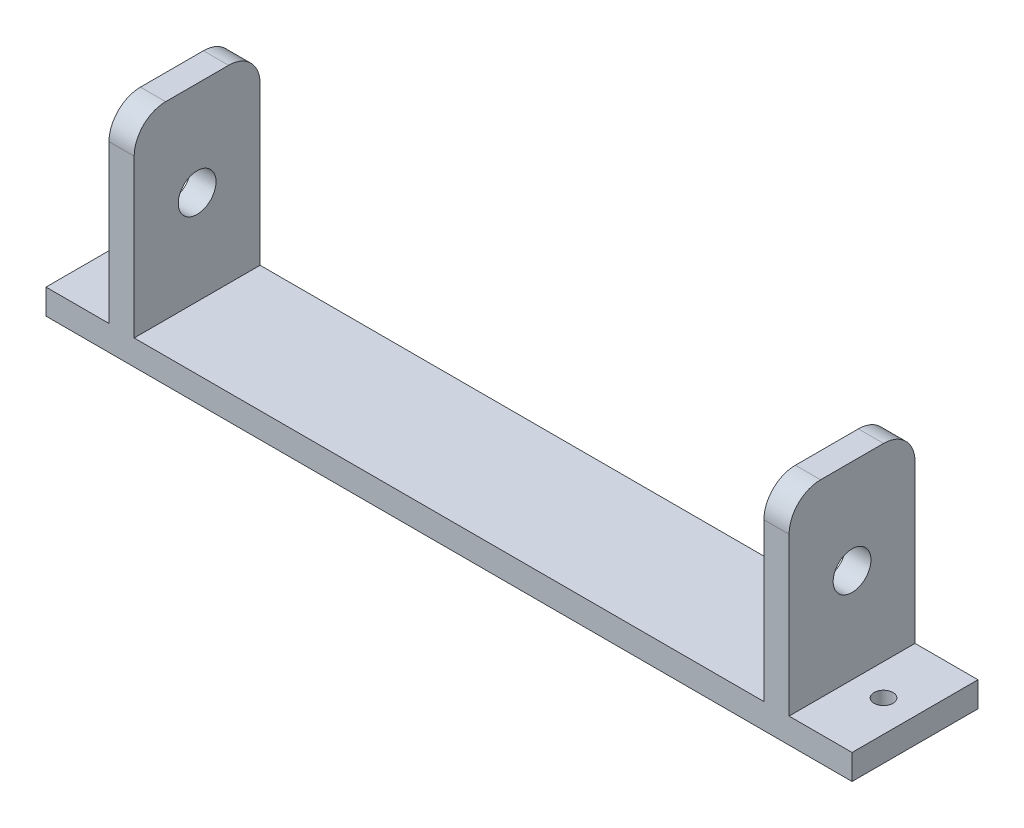
ISO-10303-21;
HEADER;
FILE_DESCRIPTION(('STEP AP214'),'2;1');
FILE_NAME('part.step','',(''),(''),'','','');
FILE_SCHEMA(('AUTOMOTIVE_DESIGN { 1 0 10303 214 1 1 1 1 }'));
ENDSEC;
DATA;
#1=APPLICATION_CONTEXT('core data for automotive mechanical design processes');
#2=APPLICATION_PROTOCOL_DEFINITION('international standard','automotive_design',2000,#1);
#3=PRODUCT_CONTEXT('',#1,'mechanical');
#4=PRODUCT('Part','Part','',(#3));
#5=PRODUCT_RELATED_PRODUCT_CATEGORY('part','',(#4));
#6=PRODUCT_DEFINITION_FORMATION('','',#4);
#7=PRODUCT_DEFINITION_CONTEXT('part definition',#1,'design');
#8=PRODUCT_DEFINITION('design','',#6,#7);
#9=PRODUCT_DEFINITION_SHAPE('','',#8);
#10=(LENGTH_UNIT() NAMED_UNIT(*) SI_UNIT(.MILLI.,.METRE.));
#11=(NAMED_UNIT(*) PLANE_ANGLE_UNIT() SI_UNIT($,.RADIAN.));
#12=(NAMED_UNIT(*) SI_UNIT($,.STERADIAN.) SOLID_ANGLE_UNIT());
#13=UNCERTAINTY_MEASURE_WITH_UNIT(LENGTH_MEASURE(1.E-05),#10,'distance_accuracy_value','');
#14=(GEOMETRIC_REPRESENTATION_CONTEXT(3) GLOBAL_UNCERTAINTY_ASSIGNED_CONTEXT((#13)) GLOBAL_UNIT_ASSIGNED_CONTEXT((#10,
#11,#12)) REPRESENTATION_CONTEXT('',''));
#15=CARTESIAN_POINT('',(0.,0.,0.));
#16=DIRECTION('',(0.,0.,1.));
#17=DIRECTION('',(1.,0.,0.));
#18=AXIS2_PLACEMENT_3D('',#15,#16,#17);
#19=CARTESIAN_POINT('',(-93.7318307472802,25.7527777777778,20.));
#20=DIRECTION('',(1.,0.,0.));
#21=DIRECTION('',(0.,0.,-1.));
#22=AXIS2_PLACEMENT_3D('',#19,#20,#21);
#23=PLANE('',#22);
#24=CARTESIAN_POINT('',(-93.7318307472802,10.7527777777778,10.));
#25=DIRECTION('',(-1.,0.,0.));
#26=DIRECTION('',(0.,0.,1.));
#27=AXIS2_PLACEMENT_3D('',#24,#25,#26);
#28=CIRCLE('',#27,3.);
#29=CARTESIAN_POINT('',(-93.7318307472802,10.7527777777778,13.));
#30=VERTEX_POINT('',#29);
#31=EDGE_CURVE('E221',#30,#30,#28,.T.);
#32=ORIENTED_EDGE('',*,*,#31,.F.);
#33=EDGE_LOOP('',(#32));
#34=FACE_BOUND('',#33,.T.);
#35=DIRECTION('',(0.,0.,-1.));
#36=VECTOR('',#35,1.);
#37=CARTESIAN_POINT('',(-93.7318307472802,-4.24722222222222,0.));
#38=LINE('',#37,#36);
#39=CARTESIAN_POINT('',(-93.7318307472802,-4.24722222222222,20.));
#40=VERTEX_POINT('',#39);
#41=CARTESIAN_POINT('',(-93.7318307472802,-4.24722222222222,0.));
#42=VERTEX_POINT('',#41);
#43=EDGE_CURVE('E49',#40,#42,#38,.T.);
#44=ORIENTED_EDGE('',*,*,#43,.F.);
#45=DIRECTION('',(0.,-1.,0.));
#46=VECTOR('',#45,1.);
#47=CARTESIAN_POINT('',(-93.7318307472802,25.7527777777778,20.));
#48=LINE('',#47,#46);
#49=CARTESIAN_POINT('',(-93.7318307472802,20.7527777777778,20.));
#50=VERTEX_POINT('',#49);
#51=EDGE_CURVE('E233',#50,#40,#48,.T.);
#52=ORIENTED_EDGE('',*,*,#51,.F.);
#53=CARTESIAN_POINT('',(-93.7318307472802,20.7527777777778,15.));
#54=DIRECTION('',(1.,0.,0.));
#55=DIRECTION('',(0.,0.,-1.));
#56=AXIS2_PLACEMENT_3D('',#53,#54,#55);
#57=CIRCLE('',#56,5.);
#58=CARTESIAN_POINT('',(-93.7318307472802,25.7527777777778,15.));
#59=VERTEX_POINT('',#58);
#60=EDGE_CURVE('E271',#50,#59,#57,.F.);
#61=ORIENTED_EDGE('',*,*,#60,.T.);
#62=DIRECTION('',(0.,0.,-1.));
#63=VECTOR('',#62,1.);
#64=CARTESIAN_POINT('',(-93.7318307472802,25.7527777777778,20.));
#65=LINE('',#64,#63);
#66=CARTESIAN_POINT('',(-93.7318307472802,25.7527777777778,5.));
#67=VERTEX_POINT('',#66);
#68=EDGE_CURVE('E298',#59,#67,#65,.T.);
#69=ORIENTED_EDGE('',*,*,#68,.T.);
#70=CARTESIAN_POINT('',(-93.7318307472802,20.7527777777778,5.));
#71=DIRECTION('',(1.,0.,0.));
#72=DIRECTION('',(0.,0.,-1.));
#73=AXIS2_PLACEMENT_3D('',#70,#71,#72);
#74=CIRCLE('',#73,5.);
#75=CARTESIAN_POINT('',(-93.7318307472802,20.7527777777778,0.));
#76=VERTEX_POINT('',#75);
#77=EDGE_CURVE('E273',#67,#76,#74,.F.);
#78=ORIENTED_EDGE('',*,*,#77,.T.);
#79=DIRECTION('',(0.,-1.,0.));
#80=VECTOR('',#79,1.);
#81=CARTESIAN_POINT('',(-93.7318307472802,25.7527777777778,0.));
#82=LINE('',#81,#80);
#83=EDGE_CURVE('E160',#76,#42,#82,.T.);
#84=ORIENTED_EDGE('',*,*,#83,.T.);
#85=EDGE_LOOP('',(#44,#52,#61,#69,#78,#84));
#86=FACE_BOUND('',#85,.T.);
#87=ADVANCED_FACE('F32',(#34,#86),#23,.F.);
#88=CARTESIAN_POINT('',(14.2681692527198,-8.24722222222222,20.));
#89=DIRECTION('',(-1.,0.,0.));
#90=DIRECTION('',(0.,0.,1.));
#91=AXIS2_PLACEMENT_3D('',#88,#89,#90);
#92=PLANE('',#91);
#93=CARTESIAN_POINT('',(14.2681692527198,10.7527777777778,10.));
#94=DIRECTION('',(1.,0.,0.));
#95=DIRECTION('',(0.,0.,-1.));
#96=AXIS2_PLACEMENT_3D('',#93,#94,#95);
#97=CIRCLE('',#96,3.);
#98=CARTESIAN_POINT('',(14.2681692527198,10.7527777777778,7.));
#99=VERTEX_POINT('',#98);
#100=EDGE_CURVE('E222',#99,#99,#97,.T.);
#101=ORIENTED_EDGE('',*,*,#100,.F.);
#102=EDGE_LOOP('',(#101));
#103=FACE_BOUND('',#102,.T.);
#104=DIRECTION('',(0.,0.,1.));
#105=VECTOR('',#104,1.);
#106=CARTESIAN_POINT('',(14.2681692527198,-4.24722222222222,20.));
#107=LINE('',#106,#105);
#108=CARTESIAN_POINT('',(14.2681692527198,-4.24722222222222,0.));
#109=VERTEX_POINT('',#108);
#110=CARTESIAN_POINT('',(14.2681692527198,-4.24722222222222,20.));
#111=VERTEX_POINT('',#110);
#112=EDGE_CURVE('E57',#109,#111,#107,.T.);
#113=ORIENTED_EDGE('',*,*,#112,.F.);
#114=DIRECTION('',(0.,1.,0.));
#115=VECTOR('',#114,1.);
#116=CARTESIAN_POINT('',(14.2681692527198,-8.24722222222222,0.));
#117=LINE('',#116,#115);
#118=CARTESIAN_POINT('',(14.2681692527198,20.7527777777778,0.));
#119=VERTEX_POINT('',#118);
#120=EDGE_CURVE('E159',#109,#119,#117,.T.);
#121=ORIENTED_EDGE('',*,*,#120,.T.);
#122=CARTESIAN_POINT('',(14.2681692527198,20.7527777777778,5.));
#123=DIRECTION('',(-1.,0.,0.));
#124=DIRECTION('',(0.,0.,1.));
#125=AXIS2_PLACEMENT_3D('',#122,#123,#124);
#126=CIRCLE('',#125,5.);
#127=CARTESIAN_POINT('',(14.2681692527198,25.7527777777778,5.));
#128=VERTEX_POINT('',#127);
#129=EDGE_CURVE('E280',#119,#128,#126,.F.);
#130=ORIENTED_EDGE('',*,*,#129,.T.);
#131=DIRECTION('',(0.,0.,-1.));
#132=VECTOR('',#131,1.);
#133=CARTESIAN_POINT('',(14.2681692527198,25.7527777777778,20.));
#134=LINE('',#133,#132);
#135=CARTESIAN_POINT('',(14.2681692527198,25.7527777777778,15.));
#136=VERTEX_POINT('',#135);
#137=EDGE_CURVE('E301',#136,#128,#134,.T.);
#138=ORIENTED_EDGE('',*,*,#137,.F.);
#139=CARTESIAN_POINT('',(14.2681692527198,20.7527777777778,15.));
#140=DIRECTION('',(-1.,0.,0.));
#141=DIRECTION('',(0.,0.,1.));
#142=AXIS2_PLACEMENT_3D('',#139,#140,#141);
#143=CIRCLE('',#142,5.);
#144=CARTESIAN_POINT('',(14.2681692527198,20.7527777777778,20.));
#145=VERTEX_POINT('',#144);
#146=EDGE_CURVE('E282',#136,#145,#143,.F.);
#147=ORIENTED_EDGE('',*,*,#146,.T.);
#148=DIRECTION('',(0.,1.,0.));
#149=VECTOR('',#148,1.);
#150=CARTESIAN_POINT('',(14.2681692527198,-8.24722222222222,20.));
#151=LINE('',#150,#149);
#152=EDGE_CURVE('E208',#111,#145,#151,.T.);
#153=ORIENTED_EDGE('',*,*,#152,.F.);
#154=EDGE_LOOP('',(#113,#121,#130,#138,#147,#153));
#155=FACE_BOUND('',#154,.T.);
#156=ADVANCED_FACE('F358',(#103,#155),#92,.F.);
#157=CARTESIAN_POINT('',(-93.7318307472802,25.7527777777778,20.));
#158=DIRECTION('',(0.,-1.,0.));
#159=DIRECTION('',(0.,0.,-1.));
#160=AXIS2_PLACEMENT_3D('',#157,#158,#159);
#161=PLANE('',#160);
#162=ORIENTED_EDGE('',*,*,#68,.F.);
#163=DIRECTION('',(-1.,0.,0.));
#164=VECTOR('',#163,1.);
#165=CARTESIAN_POINT('',(-93.7318307472802,25.7527777777778,15.));
#166=LINE('',#165,#164);
#167=CARTESIAN_POINT('',(-89.7318307472802,25.7527777777778,15.));
#168=VERTEX_POINT('',#167);
#169=EDGE_CURVE('E266',#59,#168,#166,.F.);
#170=ORIENTED_EDGE('',*,*,#169,.T.);
#171=DIRECTION('',(0.,0.,-1.));
#172=VECTOR('',#171,1.);
#173=CARTESIAN_POINT('',(-89.7318307472802,25.7527777777778,20.));
#174=LINE('',#173,#172);
#175=CARTESIAN_POINT('',(-89.7318307472802,25.7527777777778,5.));
#176=VERTEX_POINT('',#175);
#177=EDGE_CURVE('E257',#168,#176,#174,.T.);
#178=ORIENTED_EDGE('',*,*,#177,.T.);
#179=DIRECTION('',(-1.,0.,0.));
#180=VECTOR('',#179,1.);
#181=CARTESIAN_POINT('',(-93.7318307472802,25.7527777777778,5.));
#182=LINE('',#181,#180);
#183=EDGE_CURVE('E268',#176,#67,#182,.T.);
#184=ORIENTED_EDGE('',*,*,#183,.T.);
#185=EDGE_LOOP('',(#162,#170,#178,#184));
#186=FACE_BOUND('',#185,.T.);
#187=ADVANCED_FACE('F338',(#186),#161,.F.);
#188=CARTESIAN_POINT('',(-93.7318307472802,-8.24722222222222,20.));
#189=DIRECTION('',(0.,1.,0.));
#190=DIRECTION('',(0.,0.,1.));
#191=AXIS2_PLACEMENT_3D('',#188,#189,#190);
#192=PLANE('',#191);
#193=CARTESIAN_POINT('',(19.2681692527198,-8.24722222222222,10.));
#194=DIRECTION('',(0.,1.,0.));
#195=DIRECTION('',(0.,0.,1.));
#196=AXIS2_PLACEMENT_3D('',#193,#194,#195);
#197=CIRCLE('',#196,1.5);
#198=CARTESIAN_POINT('',(19.2681692527198,-8.24722222222222,11.5));
#199=VERTEX_POINT('',#198);
#200=EDGE_CURVE('E525',#199,#199,#197,.T.);
#201=ORIENTED_EDGE('',*,*,#200,.T.);
#202=EDGE_LOOP('',(#201));
#203=FACE_BOUND('',#202,.T.);
#204=CARTESIAN_POINT('',(-98.7318307472802,-8.24722222222222,10.));
#205=DIRECTION('',(0.,1.,0.));
#206=DIRECTION('',(0.,0.,1.));
#207=AXIS2_PLACEMENT_3D('',#204,#205,#206);
#208=CIRCLE('',#207,1.5);
#209=CARTESIAN_POINT('',(-98.7318307472802,-8.24722222222222,11.5));
#210=VERTEX_POINT('',#209);
#211=EDGE_CURVE('E175',#210,#210,#208,.T.);
#212=ORIENTED_EDGE('',*,*,#211,.T.);
#213=EDGE_LOOP('',(#212));
#214=FACE_BOUND('',#213,.T.);
#215=DIRECTION('',(1.,0.,0.));
#216=VECTOR('',#215,1.);
#217=CARTESIAN_POINT('',(-93.7318307472802,-8.24722222222222,0.));
#218=LINE('',#217,#216);
#219=CARTESIAN_POINT('',(-103.73183074728,-8.24722222222222,0.));
#220=VERTEX_POINT('',#219);
#221=CARTESIAN_POINT('',(24.2681692527198,-8.24722222222222,0.));
#222=VERTEX_POINT('',#221);
#223=EDGE_CURVE('E147',#220,#222,#218,.T.);
#224=ORIENTED_EDGE('',*,*,#223,.T.);
#225=DIRECTION('',(0.,0.,-1.));
#226=VECTOR('',#225,1.);
#227=CARTESIAN_POINT('',(24.2681692527198,-8.24722222222222,20.));
#228=LINE('',#227,#226);
#229=CARTESIAN_POINT('',(24.2681692527198,-8.24722222222222,20.));
#230=VERTEX_POINT('',#229);
#231=EDGE_CURVE('E204',#230,#222,#228,.T.);
#232=ORIENTED_EDGE('',*,*,#231,.F.);
#233=DIRECTION('',(1.,0.,0.));
#234=VECTOR('',#233,1.);
#235=CARTESIAN_POINT('',(-93.7318307472802,-8.24722222222222,20.));
#236=LINE('',#235,#234);
#237=CARTESIAN_POINT('',(-103.73183074728,-8.24722222222222,20.));
#238=VERTEX_POINT('',#237);
#239=EDGE_CURVE('E165',#238,#230,#236,.T.);
#240=ORIENTED_EDGE('',*,*,#239,.F.);
#241=DIRECTION('',(0.,0.,1.));
#242=VECTOR('',#241,1.);
#243=CARTESIAN_POINT('',(-103.73183074728,-8.24722222222222,0.));
#244=LINE('',#243,#242);
#245=EDGE_CURVE('E163',#220,#238,#244,.T.);
#246=ORIENTED_EDGE('',*,*,#245,.F.);
#247=EDGE_LOOP('',(#224,#232,#240,#246));
#248=FACE_BOUND('',#247,.T.);
#249=ADVANCED_FACE('F164',(#203,#214,#248),#192,.F.);
#250=CARTESIAN_POINT('',(10.2681692527198,25.7527777777778,20.));
#251=DIRECTION('',(0.,-1.,0.));
#252=DIRECTION('',(0.,0.,-1.));
#253=AXIS2_PLACEMENT_3D('',#250,#251,#252);
#254=PLANE('',#253);
#255=ORIENTED_EDGE('',*,*,#137,.T.);
#256=DIRECTION('',(-1.,0.,0.));
#257=VECTOR('',#256,1.);
#258=CARTESIAN_POINT('',(10.2681692527198,25.7527777777778,5.));
#259=LINE('',#258,#257);
#260=CARTESIAN_POINT('',(10.2681692527198,25.7527777777778,5.));
#261=VERTEX_POINT('',#260);
#262=EDGE_CURVE('E293',#128,#261,#259,.T.);
#263=ORIENTED_EDGE('',*,*,#262,.T.);
#264=DIRECTION('',(0.,0.,-1.));
#265=VECTOR('',#264,1.);
#266=CARTESIAN_POINT('',(10.2681692527198,25.7527777777778,20.));
#267=LINE('',#266,#265);
#268=CARTESIAN_POINT('',(10.2681692527198,25.7527777777778,15.));
#269=VERTEX_POINT('',#268);
#270=EDGE_CURVE('E304',#269,#261,#267,.T.);
#271=ORIENTED_EDGE('',*,*,#270,.F.);
#272=DIRECTION('',(-1.,0.,0.));
#273=VECTOR('',#272,1.);
#274=CARTESIAN_POINT('',(10.2681692527198,25.7527777777778,15.));
#275=LINE('',#274,#273);
#276=EDGE_CURVE('E296',#269,#136,#275,.F.);
#277=ORIENTED_EDGE('',*,*,#276,.T.);
#278=EDGE_LOOP('',(#255,#263,#271,#277));
#279=FACE_BOUND('',#278,.T.);
#280=ADVANCED_FACE('F394',(#279),#254,.F.);
#281=CARTESIAN_POINT('',(10.2681692527198,-4.24722222222222,20.));
#282=DIRECTION('',(1.,0.,0.));
#283=DIRECTION('',(0.,0.,-1.));
#284=AXIS2_PLACEMENT_3D('',#281,#282,#283);
#285=PLANE('',#284);
#286=CARTESIAN_POINT('',(10.2681692527198,10.7527777777778,10.));
#287=DIRECTION('',(1.,0.,0.));
#288=DIRECTION('',(0.,0.,-1.));
#289=AXIS2_PLACEMENT_3D('',#286,#287,#288);
#290=CIRCLE('',#289,3.);
#291=CARTESIAN_POINT('',(10.2681692527198,10.7527777777778,7.));
#292=VERTEX_POINT('',#291);
#293=EDGE_CURVE('E218',#292,#292,#290,.T.);
#294=ORIENTED_EDGE('',*,*,#293,.T.);
#295=EDGE_LOOP('',(#294));
#296=FACE_BOUND('',#295,.T.);
#297=ORIENTED_EDGE('',*,*,#270,.T.);
#298=CARTESIAN_POINT('',(10.2681692527198,20.7527777777778,5.));
#299=DIRECTION('',(1.,0.,0.));
#300=DIRECTION('',(0.,0.,-1.));
#301=AXIS2_PLACEMENT_3D('',#298,#299,#300);
#302=CIRCLE('',#301,5.);
#303=CARTESIAN_POINT('',(10.2681692527198,20.7527777777778,0.));
#304=VERTEX_POINT('',#303);
#305=EDGE_CURVE('E289',#261,#304,#302,.F.);
#306=ORIENTED_EDGE('',*,*,#305,.T.);
#307=DIRECTION('',(0.,-1.,0.));
#308=VECTOR('',#307,1.);
#309=CARTESIAN_POINT('',(10.2681692527198,-4.24722222222222,0.));
#310=LINE('',#309,#308);
#311=CARTESIAN_POINT('',(10.2681692527198,-4.24722222222222,0.));
#312=VERTEX_POINT('',#311);
#313=EDGE_CURVE('E262',#304,#312,#310,.T.);
#314=ORIENTED_EDGE('',*,*,#313,.T.);
#315=DIRECTION('',(0.,0.,-1.));
#316=VECTOR('',#315,1.);
#317=CARTESIAN_POINT('',(10.2681692527198,-4.24722222222222,20.));
#318=LINE('',#317,#316);
#319=CARTESIAN_POINT('',(10.2681692527198,-4.24722222222222,20.));
#320=VERTEX_POINT('',#319);
#321=EDGE_CURVE('E307',#320,#312,#318,.T.);
#322=ORIENTED_EDGE('',*,*,#321,.F.);
#323=DIRECTION('',(0.,-1.,0.));
#324=VECTOR('',#323,1.);
#325=CARTESIAN_POINT('',(10.2681692527198,-4.24722222222222,20.));
#326=LINE('',#325,#324);
#327=CARTESIAN_POINT('',(10.2681692527198,20.7527777777778,20.));
#328=VERTEX_POINT('',#327);
#329=EDGE_CURVE('E246',#328,#320,#326,.T.);
#330=ORIENTED_EDGE('',*,*,#329,.F.);
#331=CARTESIAN_POINT('',(10.2681692527198,20.7527777777778,15.));
#332=DIRECTION('',(1.,0.,0.));
#333=DIRECTION('',(0.,0.,-1.));
#334=AXIS2_PLACEMENT_3D('',#331,#332,#333);
#335=CIRCLE('',#334,5.);
#336=EDGE_CURVE('E291',#328,#269,#335,.F.);
#337=ORIENTED_EDGE('',*,*,#336,.T.);
#338=EDGE_LOOP('',(#297,#306,#314,#322,#330,#337));
#339=FACE_BOUND('',#338,.T.);
#340=ADVANCED_FACE('F321',(#296,#339),#285,.F.);
#341=CARTESIAN_POINT('',(-89.7318307472802,-4.24722222222222,20.));
#342=DIRECTION('',(0.,-1.,0.));
#343=DIRECTION('',(0.,0.,-1.));
#344=AXIS2_PLACEMENT_3D('',#341,#342,#343);
#345=PLANE('',#344);
#346=DIRECTION('',(-1.,0.,0.));
#347=VECTOR('',#346,1.);
#348=CARTESIAN_POINT('',(-89.7318307472802,-4.24722222222222,0.));
#349=LINE('',#348,#347);
#350=CARTESIAN_POINT('',(-89.7318307472802,-4.24722222222222,0.));
#351=VERTEX_POINT('',#350);
#352=EDGE_CURVE('E316',#312,#351,#349,.T.);
#353=ORIENTED_EDGE('',*,*,#352,.T.);
#354=DIRECTION('',(0.,0.,-1.));
#355=VECTOR('',#354,1.);
#356=CARTESIAN_POINT('',(-89.7318307472802,-4.24722222222222,20.));
#357=LINE('',#356,#355);
#358=CARTESIAN_POINT('',(-89.7318307472802,-4.24722222222222,20.));
#359=VERTEX_POINT('',#358);
#360=EDGE_CURVE('E310',#359,#351,#357,.T.);
#361=ORIENTED_EDGE('',*,*,#360,.F.);
#362=DIRECTION('',(-1.,0.,0.));
#363=VECTOR('',#362,1.);
#364=CARTESIAN_POINT('',(-89.7318307472802,-4.24722222222222,20.));
#365=LINE('',#364,#363);
#366=EDGE_CURVE('E249',#320,#359,#365,.T.);
#367=ORIENTED_EDGE('',*,*,#366,.F.);
#368=ORIENTED_EDGE('',*,*,#321,.T.);
#369=EDGE_LOOP('',(#353,#361,#367,#368));
#370=FACE_BOUND('',#369,.T.);
#371=ADVANCED_FACE('F324',(#370),#345,.F.);
#372=CARTESIAN_POINT('',(-89.7318307472802,25.7527777777778,20.));
#373=DIRECTION('',(-1.,0.,0.));
#374=DIRECTION('',(0.,0.,1.));
#375=AXIS2_PLACEMENT_3D('',#372,#373,#374);
#376=PLANE('',#375);
#377=CARTESIAN_POINT('',(-89.7318307472802,10.7527777777778,10.));
#378=DIRECTION('',(-1.,0.,0.));
#379=DIRECTION('',(0.,0.,1.));
#380=AXIS2_PLACEMENT_3D('',#377,#378,#379);
#381=CIRCLE('',#380,3.);
#382=CARTESIAN_POINT('',(-89.7318307472802,10.7527777777778,13.));
#383=VERTEX_POINT('',#382);
#384=EDGE_CURVE('E226',#383,#383,#381,.T.);
#385=ORIENTED_EDGE('',*,*,#384,.T.);
#386=EDGE_LOOP('',(#385));
#387=FACE_BOUND('',#386,.T.);
#388=ORIENTED_EDGE('',*,*,#177,.F.);
#389=CARTESIAN_POINT('',(-89.7318307472802,20.7527777777778,15.));
#390=DIRECTION('',(-1.,0.,0.));
#391=DIRECTION('',(0.,0.,1.));
#392=AXIS2_PLACEMENT_3D('',#389,#390,#391);
#393=CIRCLE('',#392,5.);
#394=CARTESIAN_POINT('',(-89.7318307472802,20.7527777777778,20.));
#395=VERTEX_POINT('',#394);
#396=EDGE_CURVE('E11',#168,#395,#393,.F.);
#397=ORIENTED_EDGE('',*,*,#396,.T.);
#398=DIRECTION('',(0.,1.,0.));
#399=VECTOR('',#398,1.);
#400=CARTESIAN_POINT('',(-89.7318307472802,25.7527777777778,20.));
#401=LINE('',#400,#399);
#402=EDGE_CURVE('E253',#359,#395,#401,.T.);
#403=ORIENTED_EDGE('',*,*,#402,.F.);
#404=ORIENTED_EDGE('',*,*,#360,.T.);
#405=DIRECTION('',(0.,1.,0.));
#406=VECTOR('',#405,1.);
#407=CARTESIAN_POINT('',(-89.7318307472802,25.7527777777778,0.));
#408=LINE('',#407,#406);
#409=CARTESIAN_POINT('',(-89.7318307472802,20.7527777777778,0.));
#410=VERTEX_POINT('',#409);
#411=EDGE_CURVE('E235',#351,#410,#408,.T.);
#412=ORIENTED_EDGE('',*,*,#411,.T.);
#413=CARTESIAN_POINT('',(-89.7318307472802,20.7527777777778,5.));
#414=DIRECTION('',(-1.,0.,0.));
#415=DIRECTION('',(0.,0.,1.));
#416=AXIS2_PLACEMENT_3D('',#413,#414,#415);
#417=CIRCLE('',#416,5.);
#418=EDGE_CURVE('E41',#410,#176,#417,.F.);
#419=ORIENTED_EDGE('',*,*,#418,.T.);
#420=EDGE_LOOP('',(#388,#397,#403,#404,#412,#419));
#421=FACE_BOUND('',#420,.T.);
#422=ADVANCED_FACE('F331',(#387,#421),#376,.F.);
#423=CARTESIAN_POINT('',(0.,0.,20.));
#424=DIRECTION('',(0.,0.,-1.));
#425=DIRECTION('',(-1.,0.,0.));
#426=AXIS2_PLACEMENT_3D('',#423,#424,#425);
#427=PLANE('',#426);
#428=ORIENTED_EDGE('',*,*,#402,.T.);
#429=DIRECTION('',(-1.,0.,0.));
#430=VECTOR('',#429,1.);
#431=CARTESIAN_POINT('',(0.,20.7527777777778,20.));
#432=LINE('',#431,#430);
#433=EDGE_CURVE('E275',#395,#50,#432,.T.);
#434=ORIENTED_EDGE('',*,*,#433,.T.);
#435=ORIENTED_EDGE('',*,*,#51,.T.);
#436=DIRECTION('',(1.,0.,0.));
#437=VECTOR('',#436,1.);
#438=CARTESIAN_POINT('',(-103.73183074728,-4.24722222222222,20.));
#439=LINE('',#438,#437);
#440=CARTESIAN_POINT('',(-103.73183074728,-4.24722222222222,20.));
#441=VERTEX_POINT('',#440);
#442=EDGE_CURVE('E193',#441,#40,#439,.T.);
#443=ORIENTED_EDGE('',*,*,#442,.F.);
#444=DIRECTION('',(0.,1.,0.));
#445=VECTOR('',#444,1.);
#446=CARTESIAN_POINT('',(-103.73183074728,-8.24722222222222,20.));
#447=LINE('',#446,#445);
#448=EDGE_CURVE('E168',#238,#441,#447,.T.);
#449=ORIENTED_EDGE('',*,*,#448,.F.);
#450=ORIENTED_EDGE('',*,*,#239,.T.);
#451=DIRECTION('',(0.,-1.,0.));
#452=VECTOR('',#451,1.);
#453=CARTESIAN_POINT('',(24.2681692527198,-8.24722222222222,20.));
#454=LINE('',#453,#452);
#455=CARTESIAN_POINT('',(24.2681692527198,-4.24722222222222,20.));
#456=VERTEX_POINT('',#455);
#457=EDGE_CURVE('E186',#456,#230,#454,.T.);
#458=ORIENTED_EDGE('',*,*,#457,.F.);
#459=DIRECTION('',(-1.,0.,0.));
#460=VECTOR('',#459,1.);
#461=CARTESIAN_POINT('',(24.2681692527198,-4.24722222222222,20.));
#462=LINE('',#461,#460);
#463=EDGE_CURVE('E211',#456,#111,#462,.T.);
#464=ORIENTED_EDGE('',*,*,#463,.T.);
#465=ORIENTED_EDGE('',*,*,#152,.T.);
#466=DIRECTION('',(-1.,0.,0.));
#467=VECTOR('',#466,1.);
#468=CARTESIAN_POINT('',(0.,20.7527777777778,20.));
#469=LINE('',#468,#467);
#470=EDGE_CURVE('E278',#145,#328,#469,.T.);
#471=ORIENTED_EDGE('',*,*,#470,.T.);
#472=ORIENTED_EDGE('',*,*,#329,.T.);
#473=ORIENTED_EDGE('',*,*,#366,.T.);
#474=EDGE_LOOP('',(#428,#434,#435,#443,#449,#450,#458,#464,#465,#471,#472,#473));
#475=FACE_BOUND('',#474,.T.);
#476=ADVANCED_FACE('F245',(#475),#427,.F.);
#477=CARTESIAN_POINT('',(0.,0.,0.));
#478=DIRECTION('',(0.,0.,-1.));
#479=DIRECTION('',(-1.,0.,0.));
#480=AXIS2_PLACEMENT_3D('',#477,#478,#479);
#481=PLANE('',#480);
#482=ORIENTED_EDGE('',*,*,#313,.F.);
#483=DIRECTION('',(-1.,0.,0.));
#484=VECTOR('',#483,1.);
#485=CARTESIAN_POINT('',(14.2681692527198,20.7527777777778,0.));
#486=LINE('',#485,#484);
#487=EDGE_CURVE('E284',#304,#119,#486,.F.);
#488=ORIENTED_EDGE('',*,*,#487,.T.);
#489=ORIENTED_EDGE('',*,*,#120,.F.);
#490=DIRECTION('',(-1.,0.,0.));
#491=VECTOR('',#490,1.);
#492=CARTESIAN_POINT('',(24.2681692527198,-4.24722222222222,0.));
#493=LINE('',#492,#491);
#494=CARTESIAN_POINT('',(24.2681692527198,-4.24722222222222,0.));
#495=VERTEX_POINT('',#494);
#496=EDGE_CURVE('E225',#495,#109,#493,.T.);
#497=ORIENTED_EDGE('',*,*,#496,.F.);
#498=DIRECTION('',(0.,1.,0.));
#499=VECTOR('',#498,1.);
#500=CARTESIAN_POINT('',(24.2681692527198,-8.24722222222222,0.));
#501=LINE('',#500,#499);
#502=EDGE_CURVE('E155',#222,#495,#501,.T.);
#503=ORIENTED_EDGE('',*,*,#502,.F.);
#504=ORIENTED_EDGE('',*,*,#223,.F.);
#505=DIRECTION('',(0.,-1.,0.));
#506=VECTOR('',#505,1.);
#507=CARTESIAN_POINT('',(-103.73183074728,-8.24722222222222,0.));
#508=LINE('',#507,#506);
#509=CARTESIAN_POINT('',(-103.73183074728,-4.24722222222222,0.));
#510=VERTEX_POINT('',#509);
#511=EDGE_CURVE('E153',#510,#220,#508,.T.);
#512=ORIENTED_EDGE('',*,*,#511,.F.);
#513=DIRECTION('',(1.,0.,0.));
#514=VECTOR('',#513,1.);
#515=CARTESIAN_POINT('',(-103.73183074728,-4.24722222222222,0.));
#516=LINE('',#515,#514);
#517=EDGE_CURVE('E183',#510,#42,#516,.T.);
#518=ORIENTED_EDGE('',*,*,#517,.T.);
#519=ORIENTED_EDGE('',*,*,#83,.F.);
#520=DIRECTION('',(-1.,0.,0.));
#521=VECTOR('',#520,1.);
#522=CARTESIAN_POINT('',(-89.7318307472802,20.7527777777778,0.));
#523=LINE('',#522,#521);
#524=EDGE_CURVE('E287',#76,#410,#523,.F.);
#525=ORIENTED_EDGE('',*,*,#524,.T.);
#526=ORIENTED_EDGE('',*,*,#411,.F.);
#527=ORIENTED_EDGE('',*,*,#352,.F.);
#528=EDGE_LOOP('',(#482,#488,#489,#497,#503,#504,#512,#518,#519,#525,#526,#527));
#529=FACE_BOUND('',#528,.T.);
#530=ADVANCED_FACE('F150',(#529),#481,.T.);
#531=CARTESIAN_POINT('',(-89.7318307472802,10.7527777777778,10.));
#532=DIRECTION('',(-1.,0.,0.));
#533=DIRECTION('',(0.,0.,1.));
#534=AXIS2_PLACEMENT_3D('',#531,#532,#533);
#535=CYLINDRICAL_SURFACE('',#534,3.);
#536=ORIENTED_EDGE('',*,*,#384,.F.);
#537=EDGE_LOOP('',(#536));
#538=FACE_BOUND('',#537,.T.);
#539=ORIENTED_EDGE('',*,*,#31,.T.);
#540=EDGE_LOOP('',(#539));
#541=FACE_BOUND('',#540,.T.);
#542=ADVANCED_FACE('F413',(#538,#541),#535,.F.);
#543=CARTESIAN_POINT('',(10.2681692527198,10.7527777777778,10.));
#544=DIRECTION('',(1.,0.,0.));
#545=DIRECTION('',(0.,0.,-1.));
#546=AXIS2_PLACEMENT_3D('',#543,#544,#545);
#547=CYLINDRICAL_SURFACE('',#546,3.);
#548=ORIENTED_EDGE('',*,*,#293,.F.);
#549=EDGE_LOOP('',(#548));
#550=FACE_BOUND('',#549,.T.);
#551=ORIENTED_EDGE('',*,*,#100,.T.);
#552=EDGE_LOOP('',(#551));
#553=FACE_BOUND('',#552,.T.);
#554=ADVANCED_FACE('F374',(#550,#553),#547,.F.);
#555=CARTESIAN_POINT('',(10.2681692527198,20.7527777777778,5.));
#556=DIRECTION('',(1.,0.,0.));
#557=DIRECTION('',(0.,0.,-1.));
#558=AXIS2_PLACEMENT_3D('',#555,#556,#557);
#559=CYLINDRICAL_SURFACE('',#558,5.);
#560=ORIENTED_EDGE('',*,*,#129,.F.);
#561=ORIENTED_EDGE('',*,*,#487,.F.);
#562=ORIENTED_EDGE('',*,*,#305,.F.);
#563=ORIENTED_EDGE('',*,*,#262,.F.);
#564=EDGE_LOOP('',(#560,#561,#562,#563));
#565=FACE_BOUND('',#564,.T.);
#566=ADVANCED_FACE('F371',(#565),#559,.T.);
#567=CARTESIAN_POINT('',(0.,20.7527777777778,15.));
#568=DIRECTION('',(-1.,0.,0.));
#569=DIRECTION('',(0.,0.,1.));
#570=AXIS2_PLACEMENT_3D('',#567,#568,#569);
#571=CYLINDRICAL_SURFACE('',#570,5.);
#572=ORIENTED_EDGE('',*,*,#396,.F.);
#573=ORIENTED_EDGE('',*,*,#169,.F.);
#574=ORIENTED_EDGE('',*,*,#60,.F.);
#575=ORIENTED_EDGE('',*,*,#433,.F.);
#576=EDGE_LOOP('',(#572,#573,#574,#575));
#577=FACE_BOUND('',#576,.T.);
#578=ADVANCED_FACE('F343',(#577),#571,.T.);
#579=CARTESIAN_POINT('',(-93.7318307472802,20.7527777777778,5.));
#580=DIRECTION('',(1.,0.,0.));
#581=DIRECTION('',(0.,0.,-1.));
#582=AXIS2_PLACEMENT_3D('',#579,#580,#581);
#583=CYLINDRICAL_SURFACE('',#582,5.);
#584=ORIENTED_EDGE('',*,*,#418,.F.);
#585=ORIENTED_EDGE('',*,*,#524,.F.);
#586=ORIENTED_EDGE('',*,*,#77,.F.);
#587=ORIENTED_EDGE('',*,*,#183,.F.);
#588=EDGE_LOOP('',(#584,#585,#586,#587));
#589=FACE_BOUND('',#588,.T.);
#590=ADVANCED_FACE('F335',(#589),#583,.T.);
#591=CARTESIAN_POINT('',(0.,20.7527777777778,15.));
#592=DIRECTION('',(-1.,0.,0.));
#593=DIRECTION('',(0.,0.,1.));
#594=AXIS2_PLACEMENT_3D('',#591,#592,#593);
#595=CYLINDRICAL_SURFACE('',#594,5.);
#596=ORIENTED_EDGE('',*,*,#146,.F.);
#597=ORIENTED_EDGE('',*,*,#276,.F.);
#598=ORIENTED_EDGE('',*,*,#336,.F.);
#599=ORIENTED_EDGE('',*,*,#470,.F.);
#600=EDGE_LOOP('',(#596,#597,#598,#599));
#601=FACE_BOUND('',#600,.T.);
#602=ADVANCED_FACE('F34',(#601),#595,.T.);
#603=CARTESIAN_POINT('',(24.2681692527198,-4.24722222222222,20.));
#604=DIRECTION('',(0.,-1.,0.));
#605=DIRECTION('',(0.,0.,-1.));
#606=AXIS2_PLACEMENT_3D('',#603,#604,#605);
#607=PLANE('',#606);
#608=CARTESIAN_POINT('',(19.2681692527198,-4.24722222222222,10.));
#609=DIRECTION('',(0.,1.,0.));
#610=DIRECTION('',(0.,0.,1.));
#611=AXIS2_PLACEMENT_3D('',#608,#609,#610);
#612=CIRCLE('',#611,1.5);
#613=CARTESIAN_POINT('',(19.2681692527198,-4.24722222222222,11.5));
#614=VERTEX_POINT('',#613);
#615=EDGE_CURVE('E528',#614,#614,#612,.T.);
#616=ORIENTED_EDGE('',*,*,#615,.F.);
#617=EDGE_LOOP('',(#616));
#618=FACE_BOUND('',#617,.T.);
#619=ORIENTED_EDGE('',*,*,#112,.T.);
#620=ORIENTED_EDGE('',*,*,#463,.F.);
#621=DIRECTION('',(0.,0.,1.));
#622=VECTOR('',#621,1.);
#623=CARTESIAN_POINT('',(24.2681692527198,-4.24722222222222,20.));
#624=LINE('',#623,#622);
#625=EDGE_CURVE('E216',#495,#456,#624,.T.);
#626=ORIENTED_EDGE('',*,*,#625,.F.);
#627=ORIENTED_EDGE('',*,*,#496,.T.);
#628=EDGE_LOOP('',(#619,#620,#626,#627));
#629=FACE_BOUND('',#628,.T.);
#630=ADVANCED_FACE('F354',(#618,#629),#607,.F.);
#631=CARTESIAN_POINT('',(24.2681692527198,0.,0.));
#632=DIRECTION('',(-1.,0.,0.));
#633=DIRECTION('',(0.,0.,1.));
#634=AXIS2_PLACEMENT_3D('',#631,#632,#633);
#635=PLANE('',#634);
#636=ORIENTED_EDGE('',*,*,#457,.T.);
#637=ORIENTED_EDGE('',*,*,#231,.T.);
#638=ORIENTED_EDGE('',*,*,#502,.T.);
#639=ORIENTED_EDGE('',*,*,#625,.T.);
#640=EDGE_LOOP('',(#636,#637,#638,#639));
#641=FACE_BOUND('',#640,.T.);
#642=ADVANCED_FACE('F243',(#641),#635,.F.);
#643=CARTESIAN_POINT('',(-103.73183074728,-4.24722222222222,0.));
#644=DIRECTION('',(0.,-1.,0.));
#645=DIRECTION('',(0.,0.,-1.));
#646=AXIS2_PLACEMENT_3D('',#643,#644,#645);
#647=PLANE('',#646);
#648=CARTESIAN_POINT('',(-98.7318307472802,-4.24722222222222,10.));
#649=DIRECTION('',(0.,1.,0.));
#650=DIRECTION('',(0.,0.,1.));
#651=AXIS2_PLACEMENT_3D('',#648,#649,#650);
#652=CIRCLE('',#651,1.5);
#653=CARTESIAN_POINT('',(-98.7318307472802,-4.24722222222222,11.5));
#654=VERTEX_POINT('',#653);
#655=EDGE_CURVE('E178',#654,#654,#652,.T.);
#656=ORIENTED_EDGE('',*,*,#655,.F.);
#657=EDGE_LOOP('',(#656));
#658=FACE_BOUND('',#657,.T.);
#659=ORIENTED_EDGE('',*,*,#43,.T.);
#660=ORIENTED_EDGE('',*,*,#517,.F.);
#661=DIRECTION('',(0.,0.,-1.));
#662=VECTOR('',#661,1.);
#663=CARTESIAN_POINT('',(-103.73183074728,-4.24722222222222,0.));
#664=LINE('',#663,#662);
#665=EDGE_CURVE('E172',#441,#510,#664,.T.);
#666=ORIENTED_EDGE('',*,*,#665,.F.);
#667=ORIENTED_EDGE('',*,*,#442,.T.);
#668=EDGE_LOOP('',(#659,#660,#666,#667));
#669=FACE_BOUND('',#668,.T.);
#670=ADVANCED_FACE('F344',(#658,#669),#647,.F.);
#671=CARTESIAN_POINT('',(-103.73183074728,0.,0.));
#672=DIRECTION('',(1.,0.,0.));
#673=DIRECTION('',(0.,0.,-1.));
#674=AXIS2_PLACEMENT_3D('',#671,#672,#673);
#675=PLANE('',#674);
#676=ORIENTED_EDGE('',*,*,#511,.T.);
#677=ORIENTED_EDGE('',*,*,#245,.T.);
#678=ORIENTED_EDGE('',*,*,#448,.T.);
#679=ORIENTED_EDGE('',*,*,#665,.T.);
#680=EDGE_LOOP('',(#676,#677,#678,#679));
#681=FACE_BOUND('',#680,.T.);
#682=ADVANCED_FACE('F170',(#681),#675,.F.);
#683=CARTESIAN_POINT('',(-98.7318307472802,-8.24722222222222,10.));
#684=DIRECTION('',(0.,1.,0.));
#685=DIRECTION('',(0.,0.,1.));
#686=AXIS2_PLACEMENT_3D('',#683,#684,#685);
#687=CYLINDRICAL_SURFACE('',#686,1.5);
#688=ORIENTED_EDGE('',*,*,#211,.F.);
#689=EDGE_LOOP('',(#688));
#690=FACE_BOUND('',#689,.T.);
#691=ORIENTED_EDGE('',*,*,#655,.T.);
#692=EDGE_LOOP('',(#691));
#693=FACE_BOUND('',#692,.T.);
#694=ADVANCED_FACE('F352',(#690,#693),#687,.F.);
#695=CARTESIAN_POINT('',(19.2681692527198,-8.24722222222222,10.));
#696=DIRECTION('',(0.,1.,0.));
#697=DIRECTION('',(0.,0.,1.));
#698=AXIS2_PLACEMENT_3D('',#695,#696,#697);
#699=CYLINDRICAL_SURFACE('',#698,1.5);
#700=ORIENTED_EDGE('',*,*,#200,.F.);
#701=EDGE_LOOP('',(#700));
#702=FACE_BOUND('',#701,.T.);
#703=ORIENTED_EDGE('',*,*,#615,.T.);
#704=EDGE_LOOP('',(#703));
#705=FACE_BOUND('',#704,.T.);
#706=ADVANCED_FACE('F508',(#702,#705),#699,.F.);
#707=CLOSED_SHELL('',(#87,#156,#187,#249,#280,#340,#371,#422,#476,#530,#542,#554,#566,#578,#590,
#602,#630,#642,#670,#682,#694,#706));
#708=MANIFOLD_SOLID_BREP('B2',#707);
#709=ADVANCED_BREP_SHAPE_REPRESENTATION('',(#18,#708),#14);
#710=SHAPE_DEFINITION_REPRESENTATION(#9,#709);
ENDSEC;
END-ISO-10303-21;
